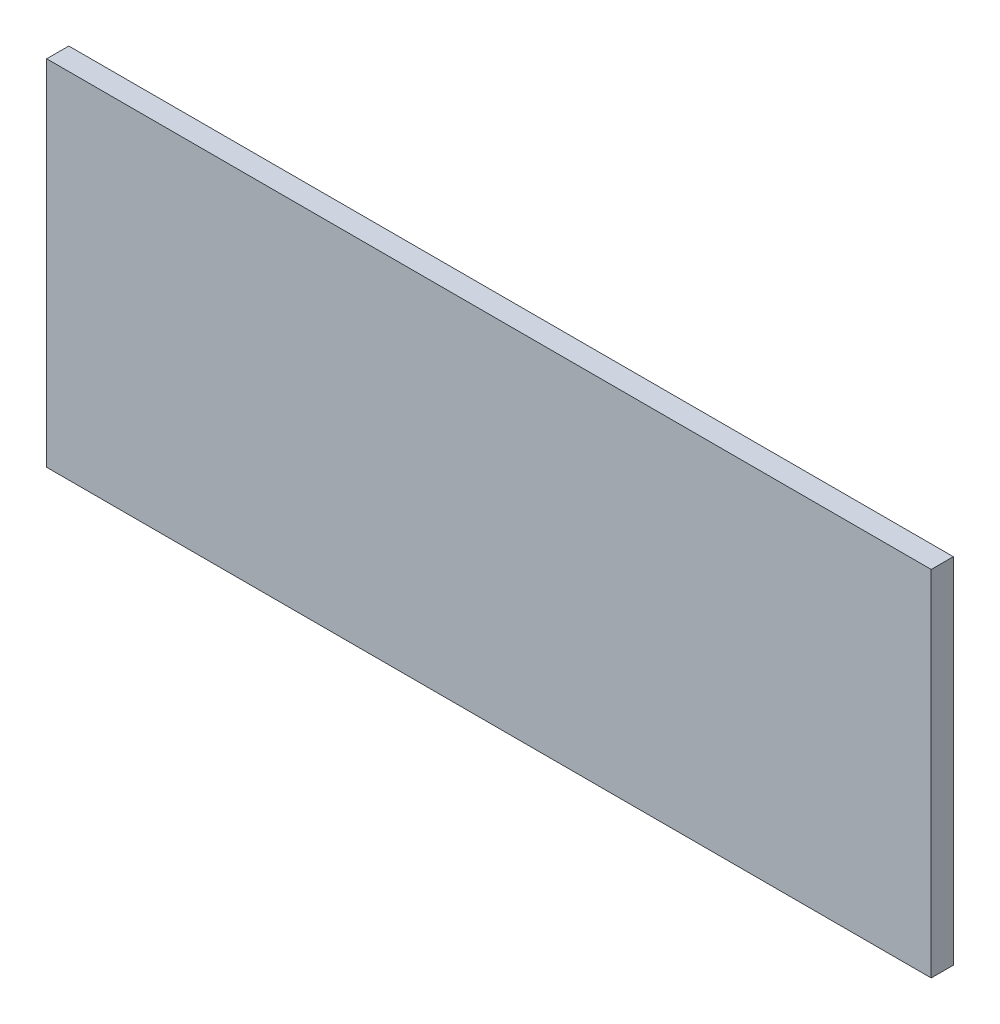
ISO-10303-21;
HEADER;
FILE_DESCRIPTION(('STEP AP214'),'2;1');
FILE_NAME('part.step','',(''),(''),'','','');
FILE_SCHEMA(('AUTOMOTIVE_DESIGN { 1 0 10303 214 1 1 1 1 }'));
ENDSEC;
DATA;
#1=APPLICATION_CONTEXT('core data for automotive mechanical design processes');
#2=APPLICATION_PROTOCOL_DEFINITION('international standard','automotive_design',2000,#1);
#3=PRODUCT_CONTEXT('',#1,'mechanical');
#4=PRODUCT('Part','Part','',(#3));
#5=PRODUCT_RELATED_PRODUCT_CATEGORY('part','',(#4));
#6=PRODUCT_DEFINITION_FORMATION('','',#4);
#7=PRODUCT_DEFINITION_CONTEXT('part definition',#1,'design');
#8=PRODUCT_DEFINITION('design','',#6,#7);
#9=PRODUCT_DEFINITION_SHAPE('','',#8);
#10=(LENGTH_UNIT() NAMED_UNIT(*) SI_UNIT(.MILLI.,.METRE.));
#11=(NAMED_UNIT(*) PLANE_ANGLE_UNIT() SI_UNIT($,.RADIAN.));
#12=(NAMED_UNIT(*) SI_UNIT($,.STERADIAN.) SOLID_ANGLE_UNIT());
#13=UNCERTAINTY_MEASURE_WITH_UNIT(LENGTH_MEASURE(1.E-05),#10,'distance_accuracy_value','');
#14=(GEOMETRIC_REPRESENTATION_CONTEXT(3) GLOBAL_UNCERTAINTY_ASSIGNED_CONTEXT((#13)) GLOBAL_UNIT_ASSIGNED_CONTEXT((#10,
#11,#12)) REPRESENTATION_CONTEXT('',''));
#15=CARTESIAN_POINT('',(0.,0.,0.));
#16=DIRECTION('',(0.,0.,1.));
#17=DIRECTION('',(1.,0.,0.));
#18=AXIS2_PLACEMENT_3D('',#15,#16,#17);
#19=CARTESIAN_POINT('',(254.,-101.6,12.7));
#20=DIRECTION('',(-1.,0.,0.));
#21=DIRECTION('',(0.,0.,1.));
#22=AXIS2_PLACEMENT_3D('',#19,#20,#21);
#23=PLANE('',#22);
#24=DIRECTION('',(0.,1.,0.));
#25=VECTOR('',#24,1.);
#26=CARTESIAN_POINT('',(254.,-101.6,0.));
#27=LINE('',#26,#25);
#28=CARTESIAN_POINT('',(254.,-101.6,0.));
#29=VERTEX_POINT('',#28);
#30=CARTESIAN_POINT('',(254.,101.6,0.));
#31=VERTEX_POINT('',#30);
#32=EDGE_CURVE('E96',#29,#31,#27,.T.);
#33=ORIENTED_EDGE('',*,*,#32,.T.);
#34=DIRECTION('',(0.,0.,-1.));
#35=VECTOR('',#34,1.);
#36=CARTESIAN_POINT('',(254.,101.6,12.7));
#37=LINE('',#36,#35);
#38=CARTESIAN_POINT('',(254.,101.6,12.7));
#39=VERTEX_POINT('',#38);
#40=EDGE_CURVE('E11',#39,#31,#37,.T.);
#41=ORIENTED_EDGE('',*,*,#40,.F.);
#42=DIRECTION('',(0.,1.,0.));
#43=VECTOR('',#42,1.);
#44=CARTESIAN_POINT('',(254.,-101.6,12.7));
#45=LINE('',#44,#43);
#46=CARTESIAN_POINT('',(254.,-101.6,12.7));
#47=VERTEX_POINT('',#46);
#48=EDGE_CURVE('E84',#47,#39,#45,.T.);
#49=ORIENTED_EDGE('',*,*,#48,.F.);
#50=DIRECTION('',(0.,0.,-1.));
#51=VECTOR('',#50,1.);
#52=CARTESIAN_POINT('',(254.,-101.6,12.7));
#53=LINE('',#52,#51);
#54=EDGE_CURVE('E92',#47,#29,#53,.T.);
#55=ORIENTED_EDGE('',*,*,#54,.T.);
#56=EDGE_LOOP('',(#33,#41,#49,#55));
#57=FACE_BOUND('',#56,.T.);
#58=ADVANCED_FACE('F33',(#57),#23,.F.);
#59=CARTESIAN_POINT('',(-254.,101.6,12.7));
#60=DIRECTION('',(0.,-1.,0.));
#61=DIRECTION('',(0.,0.,-1.));
#62=AXIS2_PLACEMENT_3D('',#59,#60,#61);
#63=PLANE('',#62);
#64=DIRECTION('',(-1.,0.,0.));
#65=VECTOR('',#64,1.);
#66=CARTESIAN_POINT('',(-254.,101.6,0.));
#67=LINE('',#66,#65);
#68=CARTESIAN_POINT('',(-254.,101.6,0.));
#69=VERTEX_POINT('',#68);
#70=EDGE_CURVE('E88',#31,#69,#67,.T.);
#71=ORIENTED_EDGE('',*,*,#70,.T.);
#72=DIRECTION('',(0.,0.,-1.));
#73=VECTOR('',#72,1.);
#74=CARTESIAN_POINT('',(-254.,101.6,12.7));
#75=LINE('',#74,#73);
#76=CARTESIAN_POINT('',(-254.,101.6,12.7));
#77=VERTEX_POINT('',#76);
#78=EDGE_CURVE('E41',#77,#69,#75,.T.);
#79=ORIENTED_EDGE('',*,*,#78,.F.);
#80=DIRECTION('',(-1.,0.,0.));
#81=VECTOR('',#80,1.);
#82=CARTESIAN_POINT('',(-254.,101.6,12.7));
#83=LINE('',#82,#81);
#84=EDGE_CURVE('E79',#39,#77,#83,.T.);
#85=ORIENTED_EDGE('',*,*,#84,.F.);
#86=ORIENTED_EDGE('',*,*,#40,.T.);
#87=EDGE_LOOP('',(#71,#79,#85,#86));
#88=FACE_BOUND('',#87,.T.);
#89=ADVANCED_FACE('F87',(#88),#63,.F.);
#90=CARTESIAN_POINT('',(-254.,-101.6,12.7));
#91=DIRECTION('',(1.,0.,0.));
#92=DIRECTION('',(0.,0.,-1.));
#93=AXIS2_PLACEMENT_3D('',#90,#91,#92);
#94=PLANE('',#93);
#95=DIRECTION('',(0.,-1.,0.));
#96=VECTOR('',#95,1.);
#97=CARTESIAN_POINT('',(-254.,-101.6,0.));
#98=LINE('',#97,#96);
#99=CARTESIAN_POINT('',(-254.,-101.6,0.));
#100=VERTEX_POINT('',#99);
#101=EDGE_CURVE('E66',#69,#100,#98,.T.);
#102=ORIENTED_EDGE('',*,*,#101,.T.);
#103=DIRECTION('',(0.,0.,-1.));
#104=VECTOR('',#103,1.);
#105=CARTESIAN_POINT('',(-254.,-101.6,12.7));
#106=LINE('',#105,#104);
#107=CARTESIAN_POINT('',(-254.,-101.6,12.7));
#108=VERTEX_POINT('',#107);
#109=EDGE_CURVE('E89',#108,#100,#106,.T.);
#110=ORIENTED_EDGE('',*,*,#109,.F.);
#111=DIRECTION('',(0.,-1.,0.));
#112=VECTOR('',#111,1.);
#113=CARTESIAN_POINT('',(-254.,-101.6,12.7));
#114=LINE('',#113,#112);
#115=EDGE_CURVE('E82',#77,#108,#114,.T.);
#116=ORIENTED_EDGE('',*,*,#115,.F.);
#117=ORIENTED_EDGE('',*,*,#78,.T.);
#118=EDGE_LOOP('',(#102,#110,#116,#117));
#119=FACE_BOUND('',#118,.T.);
#120=ADVANCED_FACE('F90',(#119),#94,.F.);
#121=CARTESIAN_POINT('',(-254.,-101.6,12.7));
#122=DIRECTION('',(0.,1.,0.));
#123=DIRECTION('',(0.,0.,1.));
#124=AXIS2_PLACEMENT_3D('',#121,#122,#123);
#125=PLANE('',#124);
#126=DIRECTION('',(1.,0.,0.));
#127=VECTOR('',#126,1.);
#128=CARTESIAN_POINT('',(-254.,-101.6,0.));
#129=LINE('',#128,#127);
#130=EDGE_CURVE('E72',#100,#29,#129,.T.);
#131=ORIENTED_EDGE('',*,*,#130,.T.);
#132=ORIENTED_EDGE('',*,*,#54,.F.);
#133=DIRECTION('',(1.,0.,0.));
#134=VECTOR('',#133,1.);
#135=CARTESIAN_POINT('',(-254.,-101.6,12.7));
#136=LINE('',#135,#134);
#137=EDGE_CURVE('E49',#108,#47,#136,.T.);
#138=ORIENTED_EDGE('',*,*,#137,.F.);
#139=ORIENTED_EDGE('',*,*,#109,.T.);
#140=EDGE_LOOP('',(#131,#132,#138,#139));
#141=FACE_BOUND('',#140,.T.);
#142=ADVANCED_FACE('F103',(#141),#125,.F.);
#143=CARTESIAN_POINT('',(0.,0.,12.7));
#144=DIRECTION('',(0.,0.,-1.));
#145=DIRECTION('',(-1.,0.,0.));
#146=AXIS2_PLACEMENT_3D('',#143,#144,#145);
#147=PLANE('',#146);
#148=ORIENTED_EDGE('',*,*,#48,.T.);
#149=ORIENTED_EDGE('',*,*,#84,.T.);
#150=ORIENTED_EDGE('',*,*,#115,.T.);
#151=ORIENTED_EDGE('',*,*,#137,.T.);
#152=EDGE_LOOP('',(#148,#149,#150,#151));
#153=FACE_BOUND('',#152,.T.);
#154=ADVANCED_FACE('F80',(#153),#147,.F.);
#155=CARTESIAN_POINT('',(0.,0.,0.));
#156=DIRECTION('',(0.,0.,-1.));
#157=DIRECTION('',(-1.,0.,0.));
#158=AXIS2_PLACEMENT_3D('',#155,#156,#157);
#159=PLANE('',#158);
#160=ORIENTED_EDGE('',*,*,#32,.F.);
#161=ORIENTED_EDGE('',*,*,#130,.F.);
#162=ORIENTED_EDGE('',*,*,#101,.F.);
#163=ORIENTED_EDGE('',*,*,#70,.F.);
#164=EDGE_LOOP('',(#160,#161,#162,#163));
#165=FACE_BOUND('',#164,.T.);
#166=ADVANCED_FACE('F106',(#165),#159,.T.);
#167=CLOSED_SHELL('',(#58,#89,#120,#142,#154,#166));
#168=MANIFOLD_SOLID_BREP('B2',#167);
#169=ADVANCED_BREP_SHAPE_REPRESENTATION('',(#18,#168),#14);
#170=SHAPE_DEFINITION_REPRESENTATION(#9,#169);
ENDSEC;
END-ISO-10303-21;
